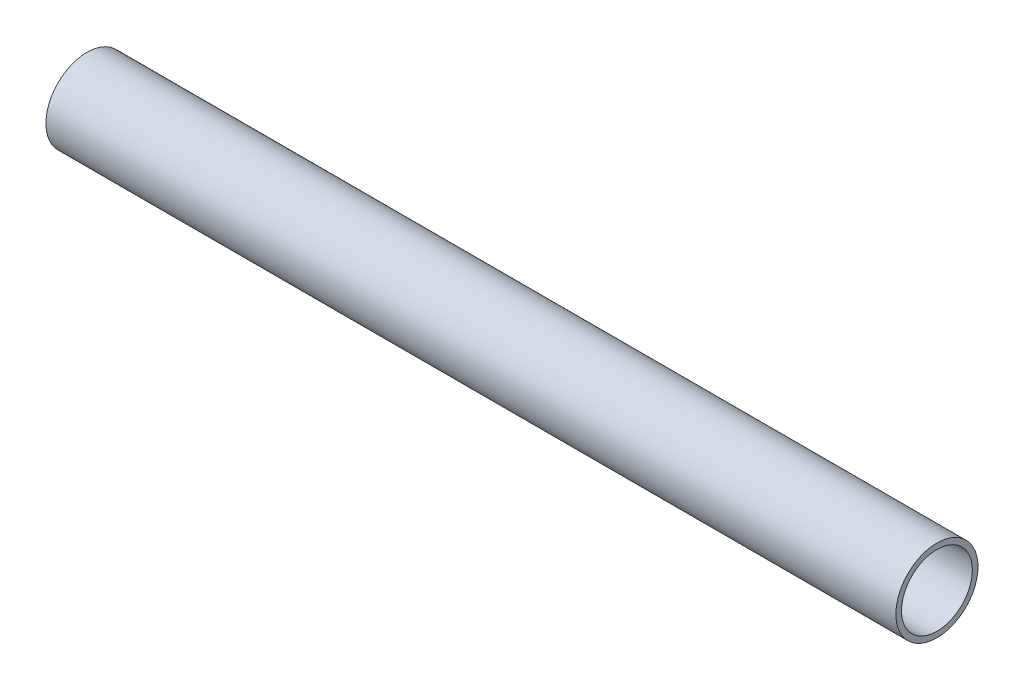
ISO-10303-21;
HEADER;
FILE_DESCRIPTION(('STEP AP214'),'2;1');
FILE_NAME('part.step','',(''),(''),'','','');
FILE_SCHEMA(('AUTOMOTIVE_DESIGN { 1 0 10303 214 1 1 1 1 }'));
ENDSEC;
DATA;
#1=APPLICATION_CONTEXT('core data for automotive mechanical design processes');
#2=APPLICATION_PROTOCOL_DEFINITION('international standard','automotive_design',2000,#1);
#3=PRODUCT_CONTEXT('',#1,'mechanical');
#4=PRODUCT('Part','Part','',(#3));
#5=PRODUCT_RELATED_PRODUCT_CATEGORY('part','',(#4));
#6=PRODUCT_DEFINITION_FORMATION('','',#4);
#7=PRODUCT_DEFINITION_CONTEXT('part definition',#1,'design');
#8=PRODUCT_DEFINITION('design','',#6,#7);
#9=PRODUCT_DEFINITION_SHAPE('','',#8);
#10=(LENGTH_UNIT() NAMED_UNIT(*) SI_UNIT(.MILLI.,.METRE.));
#11=(NAMED_UNIT(*) PLANE_ANGLE_UNIT() SI_UNIT($,.RADIAN.));
#12=(NAMED_UNIT(*) SI_UNIT($,.STERADIAN.) SOLID_ANGLE_UNIT());
#13=UNCERTAINTY_MEASURE_WITH_UNIT(LENGTH_MEASURE(1.E-05),#10,'distance_accuracy_value','');
#14=(GEOMETRIC_REPRESENTATION_CONTEXT(3) GLOBAL_UNCERTAINTY_ASSIGNED_CONTEXT((#13)) GLOBAL_UNIT_ASSIGNED_CONTEXT((#10,
#11,#12)) REPRESENTATION_CONTEXT('',''));
#15=CARTESIAN_POINT('',(0.,0.,0.));
#16=DIRECTION('',(0.,0.,1.));
#17=DIRECTION('',(1.,0.,0.));
#18=AXIS2_PLACEMENT_3D('',#15,#16,#17);
#19=CARTESIAN_POINT('',(0.,0.,0.));
#20=DIRECTION('',(1.,0.,0.));
#21=DIRECTION('',(0.,0.,-1.));
#22=AXIS2_PLACEMENT_3D('',#19,#20,#21);
#23=PLANE('',#22);
#24=CARTESIAN_POINT('',(0.,0.,0.));
#25=DIRECTION('',(1.,0.,0.));
#26=DIRECTION('',(0.,0.,-1.));
#27=AXIS2_PLACEMENT_3D('',#24,#25,#26);
#28=CIRCLE('',#27,12.5);
#29=CARTESIAN_POINT('',(0.,0.,-12.5));
#30=VERTEX_POINT('',#29);
#31=EDGE_CURVE('E52',#30,#30,#28,.T.);
#32=ORIENTED_EDGE('',*,*,#31,.T.);
#33=EDGE_LOOP('',(#32));
#34=FACE_BOUND('',#33,.T.);
#35=CARTESIAN_POINT('',(0.,0.,0.));
#36=DIRECTION('',(1.,0.,0.));
#37=DIRECTION('',(0.,0.,-1.));
#38=AXIS2_PLACEMENT_3D('',#35,#36,#37);
#39=CIRCLE('',#38,14.5);
#40=CARTESIAN_POINT('',(0.,0.,-14.5));
#41=VERTEX_POINT('',#40);
#42=EDGE_CURVE('E41',#41,#41,#39,.T.);
#43=ORIENTED_EDGE('',*,*,#42,.F.);
#44=EDGE_LOOP('',(#43));
#45=FACE_BOUND('',#44,.T.);
#46=ADVANCED_FACE('F37',(#34,#45),#23,.F.);
#47=CARTESIAN_POINT('',(300.,0.,0.));
#48=DIRECTION('',(1.,0.,0.));
#49=DIRECTION('',(0.,0.,-1.));
#50=AXIS2_PLACEMENT_3D('',#47,#48,#49);
#51=PLANE('',#50);
#52=CARTESIAN_POINT('',(300.,0.,0.));
#53=DIRECTION('',(1.,0.,0.));
#54=DIRECTION('',(0.,0.,-1.));
#55=AXIS2_PLACEMENT_3D('',#52,#53,#54);
#56=CIRCLE('',#55,12.5);
#57=CARTESIAN_POINT('',(300.,0.,-12.5));
#58=VERTEX_POINT('',#57);
#59=EDGE_CURVE('E48',#58,#58,#56,.T.);
#60=ORIENTED_EDGE('',*,*,#59,.F.);
#61=EDGE_LOOP('',(#60));
#62=FACE_BOUND('',#61,.T.);
#63=CARTESIAN_POINT('',(300.,0.,0.));
#64=DIRECTION('',(1.,0.,0.));
#65=DIRECTION('',(0.,0.,-1.));
#66=AXIS2_PLACEMENT_3D('',#63,#64,#65);
#67=CIRCLE('',#66,14.5);
#68=CARTESIAN_POINT('',(300.,0.,-14.5));
#69=VERTEX_POINT('',#68);
#70=EDGE_CURVE('E11',#69,#69,#67,.T.);
#71=ORIENTED_EDGE('',*,*,#70,.T.);
#72=EDGE_LOOP('',(#71));
#73=FACE_BOUND('',#72,.T.);
#74=ADVANCED_FACE('F65',(#62,#73),#51,.T.);
#75=CARTESIAN_POINT('',(0.,0.,0.));
#76=DIRECTION('',(1.,0.,0.));
#77=DIRECTION('',(0.,0.,-1.));
#78=AXIS2_PLACEMENT_3D('',#75,#76,#77);
#79=CYLINDRICAL_SURFACE('',#78,14.5);
#80=ORIENTED_EDGE('',*,*,#70,.F.);
#81=EDGE_LOOP('',(#80));
#82=FACE_BOUND('',#81,.T.);
#83=ORIENTED_EDGE('',*,*,#42,.T.);
#84=EDGE_LOOP('',(#83));
#85=FACE_BOUND('',#84,.T.);
#86=ADVANCED_FACE('F39',(#82,#85),#79,.T.);
#87=CARTESIAN_POINT('',(0.,0.,0.));
#88=DIRECTION('',(1.,0.,0.));
#89=DIRECTION('',(0.,0.,-1.));
#90=AXIS2_PLACEMENT_3D('',#87,#88,#89);
#91=CYLINDRICAL_SURFACE('',#90,12.5);
#92=ORIENTED_EDGE('',*,*,#59,.T.);
#93=EDGE_LOOP('',(#92));
#94=FACE_BOUND('',#93,.T.);
#95=ORIENTED_EDGE('',*,*,#31,.F.);
#96=EDGE_LOOP('',(#95));
#97=FACE_BOUND('',#96,.T.);
#98=ADVANCED_FACE('F58',(#94,#97),#91,.F.);
#99=CLOSED_SHELL('',(#46,#74,#86,#98));
#100=MANIFOLD_SOLID_BREP('B2',#99);
#101=ADVANCED_BREP_SHAPE_REPRESENTATION('',(#18,#100),#14);
#102=SHAPE_DEFINITION_REPRESENTATION(#9,#101);
ENDSEC;
END-ISO-10303-21;
